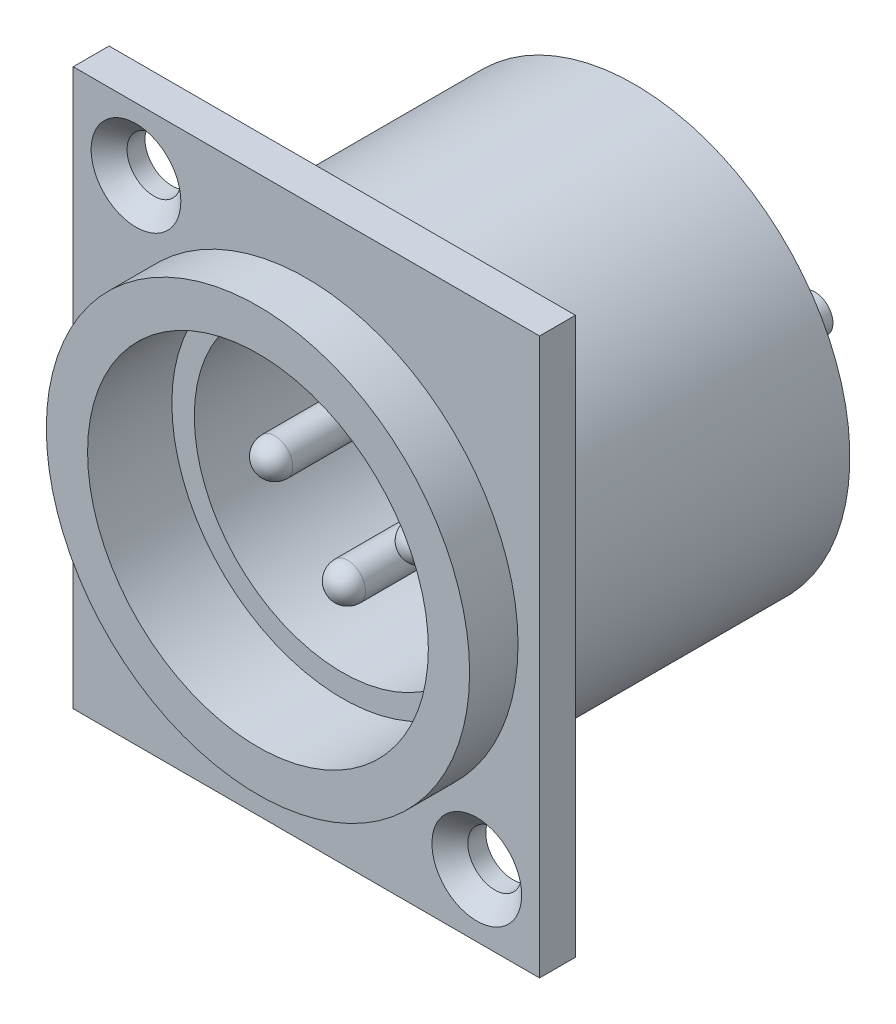
ISO-10303-21;
HEADER;
FILE_DESCRIPTION(('STEP AP214'),'2;1');
FILE_NAME('part.step','',(''),(''),'','','');
FILE_SCHEMA(('AUTOMOTIVE_DESIGN { 1 0 10303 214 1 1 1 1 }'));
ENDSEC;
DATA;
#1=APPLICATION_CONTEXT('core data for automotive mechanical design processes');
#2=APPLICATION_PROTOCOL_DEFINITION('international standard','automotive_design',2000,#1);
#3=PRODUCT_CONTEXT('',#1,'mechanical');
#4=PRODUCT('Part','Part','',(#3));
#5=PRODUCT_RELATED_PRODUCT_CATEGORY('part','',(#4));
#6=PRODUCT_DEFINITION_FORMATION('','',#4);
#7=PRODUCT_DEFINITION_CONTEXT('part definition',#1,'design');
#8=PRODUCT_DEFINITION('design','',#6,#7);
#9=PRODUCT_DEFINITION_SHAPE('','',#8);
#10=(LENGTH_UNIT() NAMED_UNIT(*) SI_UNIT(.MILLI.,.METRE.));
#11=(NAMED_UNIT(*) PLANE_ANGLE_UNIT() SI_UNIT($,.RADIAN.));
#12=(NAMED_UNIT(*) SI_UNIT($,.STERADIAN.) SOLID_ANGLE_UNIT());
#13=UNCERTAINTY_MEASURE_WITH_UNIT(LENGTH_MEASURE(1.E-05),#10,'distance_accuracy_value','');
#14=(GEOMETRIC_REPRESENTATION_CONTEXT(3) GLOBAL_UNCERTAINTY_ASSIGNED_CONTEXT((#13)) GLOBAL_UNIT_ASSIGNED_CONTEXT((#10,
#11,#12)) REPRESENTATION_CONTEXT('',''));
#15=CARTESIAN_POINT('',(0.,0.,0.));
#16=DIRECTION('',(0.,0.,1.));
#17=DIRECTION('',(1.,0.,0.));
#18=AXIS2_PLACEMENT_3D('',#15,#16,#17);
#19=CARTESIAN_POINT('',(0.,0.,2.));
#20=DIRECTION('',(0.,0.,1.));
#21=DIRECTION('',(1.,0.,0.));
#22=AXIS2_PLACEMENT_3D('',#19,#20,#21);
#23=PLANE('',#22);
#24=CARTESIAN_POINT('',(12.6835154826958,-19.6666666666667,2.));
#25=DIRECTION('',(0.,0.,1.));
#26=DIRECTION('',(1.,0.,0.));
#27=AXIS2_PLACEMENT_3D('',#24,#25,#26);
#28=CIRCLE('',#27,2.50000000000001);
#29=CARTESIAN_POINT('',(15.1835154826958,-19.6666666666667,2.));
#30=VERTEX_POINT('',#29);
#31=EDGE_CURVE('E123',#30,#30,#28,.F.);
#32=ORIENTED_EDGE('',*,*,#31,.T.);
#33=EDGE_LOOP('',(#32));
#34=FACE_BOUND('',#33,.T.);
#35=CARTESIAN_POINT('',(-6.31648451730421,4.33333333333335,2.));
#36=DIRECTION('',(0.,0.,1.));
#37=DIRECTION('',(1.,0.,0.));
#38=AXIS2_PLACEMENT_3D('',#35,#36,#37);
#39=CIRCLE('',#38,2.5);
#40=CARTESIAN_POINT('',(-3.81648451730422,4.33333333333335,2.));
#41=VERTEX_POINT('',#40);
#42=EDGE_CURVE('E120',#41,#41,#39,.F.);
#43=ORIENTED_EDGE('',*,*,#42,.T.);
#44=EDGE_LOOP('',(#43));
#45=FACE_BOUND('',#44,.T.);
#46=DIRECTION('',(0.,-1.,0.));
#47=VECTOR('',#46,1.);
#48=CARTESIAN_POINT('',(-9.81648451730421,7.83333333333335,2.));
#49=LINE('',#48,#47);
#50=CARTESIAN_POINT('',(-9.81648451730421,7.83333333333335,2.));
#51=VERTEX_POINT('',#50);
#52=CARTESIAN_POINT('',(-9.81648451730421,-23.1666666666667,2.));
#53=VERTEX_POINT('',#52);
#54=EDGE_CURVE('E92',#51,#53,#49,.T.);
#55=ORIENTED_EDGE('',*,*,#54,.T.);
#56=DIRECTION('',(1.,0.,0.));
#57=VECTOR('',#56,1.);
#58=CARTESIAN_POINT('',(-9.81648451730421,-23.1666666666667,2.));
#59=LINE('',#58,#57);
#60=CARTESIAN_POINT('',(16.1835154826958,-23.1666666666667,2.));
#61=VERTEX_POINT('',#60);
#62=EDGE_CURVE('E87',#53,#61,#59,.T.);
#63=ORIENTED_EDGE('',*,*,#62,.T.);
#64=DIRECTION('',(0.,1.,0.));
#65=VECTOR('',#64,1.);
#66=CARTESIAN_POINT('',(16.1835154826958,7.83333333333335,2.));
#67=LINE('',#66,#65);
#68=CARTESIAN_POINT('',(16.1835154826958,7.83333333333335,2.));
#69=VERTEX_POINT('',#68);
#70=EDGE_CURVE('E90',#61,#69,#67,.T.);
#71=ORIENTED_EDGE('',*,*,#70,.T.);
#72=DIRECTION('',(-1.,0.,0.));
#73=VECTOR('',#72,1.);
#74=CARTESIAN_POINT('',(-9.81648451730421,7.83333333333335,2.));
#75=LINE('',#74,#73);
#76=EDGE_CURVE('E56',#69,#51,#75,.T.);
#77=ORIENTED_EDGE('',*,*,#76,.T.);
#78=EDGE_LOOP('',(#55,#63,#71,#77));
#79=FACE_BOUND('',#78,.T.);
#80=CARTESIAN_POINT('',(3.18351548269579,-7.66666666666665,2.));
#81=DIRECTION('',(0.,0.,1.));
#82=DIRECTION('',(1.,0.,0.));
#83=AXIS2_PLACEMENT_3D('',#80,#81,#82);
#84=CIRCLE('',#83,11.8);
#85=CARTESIAN_POINT('',(14.9835154826958,-7.66666666666665,2.));
#86=VERTEX_POINT('',#85);
#87=EDGE_CURVE('E218',#86,#86,#84,.T.);
#88=ORIENTED_EDGE('',*,*,#87,.F.);
#89=EDGE_LOOP('',(#88));
#90=FACE_BOUND('',#89,.T.);
#91=ADVANCED_FACE('F39',(#34,#45,#79,#90),#23,.T.);
#92=CARTESIAN_POINT('',(0.,0.,0.));
#93=DIRECTION('',(0.,0.,1.));
#94=DIRECTION('',(1.,0.,0.));
#95=AXIS2_PLACEMENT_3D('',#92,#93,#94);
#96=PLANE('',#95);
#97=CARTESIAN_POINT('',(3.18351548269579,-7.66666666666665,0.));
#98=DIRECTION('',(0.,0.,-1.));
#99=DIRECTION('',(-1.,0.,0.));
#100=AXIS2_PLACEMENT_3D('',#97,#98,#99);
#101=CIRCLE('',#100,12.);
#102=CARTESIAN_POINT('',(-8.81648451730421,-7.66666666666665,0.));
#103=VERTEX_POINT('',#102);
#104=EDGE_CURVE('E129',#103,#103,#101,.T.);
#105=ORIENTED_EDGE('',*,*,#104,.F.);
#106=EDGE_LOOP('',(#105));
#107=FACE_BOUND('',#106,.T.);
#108=DIRECTION('',(0.,-1.,0.));
#109=VECTOR('',#108,1.);
#110=CARTESIAN_POINT('',(-9.81648451730421,7.83333333333335,0.));
#111=LINE('',#110,#109);
#112=CARTESIAN_POINT('',(-9.81648451730421,7.83333333333335,0.));
#113=VERTEX_POINT('',#112);
#114=CARTESIAN_POINT('',(-9.81648451730421,-23.1666666666667,0.));
#115=VERTEX_POINT('',#114);
#116=EDGE_CURVE('E107',#113,#115,#111,.T.);
#117=ORIENTED_EDGE('',*,*,#116,.F.);
#118=DIRECTION('',(-1.,0.,0.));
#119=VECTOR('',#118,1.);
#120=CARTESIAN_POINT('',(-9.81648451730421,7.83333333333335,0.));
#121=LINE('',#120,#119);
#122=CARTESIAN_POINT('',(16.1835154826958,7.83333333333335,0.));
#123=VERTEX_POINT('',#122);
#124=EDGE_CURVE('E79',#123,#113,#121,.T.);
#125=ORIENTED_EDGE('',*,*,#124,.F.);
#126=DIRECTION('',(0.,1.,0.));
#127=VECTOR('',#126,1.);
#128=CARTESIAN_POINT('',(16.1835154826958,7.83333333333335,0.));
#129=LINE('',#128,#127);
#130=CARTESIAN_POINT('',(16.1835154826958,-23.1666666666667,0.));
#131=VERTEX_POINT('',#130);
#132=EDGE_CURVE('E73',#131,#123,#129,.T.);
#133=ORIENTED_EDGE('',*,*,#132,.F.);
#134=DIRECTION('',(1.,0.,0.));
#135=VECTOR('',#134,1.);
#136=CARTESIAN_POINT('',(-9.81648451730421,-23.1666666666667,0.));
#137=LINE('',#136,#135);
#138=EDGE_CURVE('E97',#115,#131,#137,.T.);
#139=ORIENTED_EDGE('',*,*,#138,.F.);
#140=EDGE_LOOP('',(#117,#125,#133,#139));
#141=FACE_BOUND('',#140,.T.);
#142=CARTESIAN_POINT('',(-6.31648451730421,4.33333333333335,0.));
#143=DIRECTION('',(0.,0.,1.));
#144=DIRECTION('',(1.,0.,0.));
#145=AXIS2_PLACEMENT_3D('',#142,#143,#144);
#146=CIRCLE('',#145,1.5);
#147=CARTESIAN_POINT('',(-4.81648451730421,4.33333333333335,0.));
#148=VERTEX_POINT('',#147);
#149=EDGE_CURVE('E208',#148,#148,#146,.T.);
#150=ORIENTED_EDGE('',*,*,#149,.T.);
#151=EDGE_LOOP('',(#150));
#152=FACE_BOUND('',#151,.T.);
#153=CARTESIAN_POINT('',(12.6835154826958,-19.6666666666667,0.));
#154=DIRECTION('',(0.,0.,1.));
#155=DIRECTION('',(1.,0.,0.));
#156=AXIS2_PLACEMENT_3D('',#153,#154,#155);
#157=CIRCLE('',#156,1.5);
#158=CARTESIAN_POINT('',(14.1835154826958,-19.6666666666667,0.));
#159=VERTEX_POINT('',#158);
#160=EDGE_CURVE('E210',#159,#159,#157,.T.);
#161=ORIENTED_EDGE('',*,*,#160,.T.);
#162=EDGE_LOOP('',(#161));
#163=FACE_BOUND('',#162,.T.);
#164=ADVANCED_FACE('F159',(#107,#141,#152,#163),#96,.F.);
#165=CARTESIAN_POINT('',(-9.81648451730421,7.83333333333335,2.));
#166=DIRECTION('',(1.,0.,0.));
#167=DIRECTION('',(0.,1.,0.));
#168=AXIS2_PLACEMENT_3D('',#165,#166,#167);
#169=PLANE('',#168);
#170=ORIENTED_EDGE('',*,*,#116,.T.);
#171=DIRECTION('',(0.,0.,-1.));
#172=VECTOR('',#171,1.);
#173=CARTESIAN_POINT('',(-9.81648451730421,-23.1666666666667,2.));
#174=LINE('',#173,#172);
#175=EDGE_CURVE('E98',#53,#115,#174,.T.);
#176=ORIENTED_EDGE('',*,*,#175,.F.);
#177=ORIENTED_EDGE('',*,*,#54,.F.);
#178=DIRECTION('',(0.,0.,-1.));
#179=VECTOR('',#178,1.);
#180=CARTESIAN_POINT('',(-9.81648451730421,7.83333333333335,2.));
#181=LINE('',#180,#179);
#182=EDGE_CURVE('E103',#51,#113,#181,.T.);
#183=ORIENTED_EDGE('',*,*,#182,.T.);
#184=EDGE_LOOP('',(#170,#176,#177,#183));
#185=FACE_BOUND('',#184,.T.);
#186=ADVANCED_FACE('F165',(#185),#169,.F.);
#187=CARTESIAN_POINT('',(-9.81648451730421,-23.1666666666667,2.));
#188=DIRECTION('',(0.,1.,0.));
#189=DIRECTION('',(0.,0.,1.));
#190=AXIS2_PLACEMENT_3D('',#187,#188,#189);
#191=PLANE('',#190);
#192=ORIENTED_EDGE('',*,*,#138,.T.);
#193=DIRECTION('',(0.,0.,-1.));
#194=VECTOR('',#193,1.);
#195=CARTESIAN_POINT('',(16.1835154826958,-23.1666666666667,2.));
#196=LINE('',#195,#194);
#197=EDGE_CURVE('E95',#61,#131,#196,.T.);
#198=ORIENTED_EDGE('',*,*,#197,.F.);
#199=ORIENTED_EDGE('',*,*,#62,.F.);
#200=ORIENTED_EDGE('',*,*,#175,.T.);
#201=EDGE_LOOP('',(#192,#198,#199,#200));
#202=FACE_BOUND('',#201,.T.);
#203=ADVANCED_FACE('F96',(#202),#191,.F.);
#204=CARTESIAN_POINT('',(16.1835154826958,7.83333333333335,2.));
#205=DIRECTION('',(-1.,0.,0.));
#206=DIRECTION('',(0.,0.,1.));
#207=AXIS2_PLACEMENT_3D('',#204,#205,#206);
#208=PLANE('',#207);
#209=ORIENTED_EDGE('',*,*,#132,.T.);
#210=DIRECTION('',(0.,0.,-1.));
#211=VECTOR('',#210,1.);
#212=CARTESIAN_POINT('',(16.1835154826958,7.83333333333335,2.));
#213=LINE('',#212,#211);
#214=EDGE_CURVE('E99',#69,#123,#213,.T.);
#215=ORIENTED_EDGE('',*,*,#214,.F.);
#216=ORIENTED_EDGE('',*,*,#70,.F.);
#217=ORIENTED_EDGE('',*,*,#197,.T.);
#218=EDGE_LOOP('',(#209,#215,#216,#217));
#219=FACE_BOUND('',#218,.T.);
#220=ADVANCED_FACE('F101',(#219),#208,.F.);
#221=CARTESIAN_POINT('',(-9.81648451730421,7.83333333333335,2.));
#222=DIRECTION('',(0.,-1.,0.));
#223=DIRECTION('',(0.,0.,-1.));
#224=AXIS2_PLACEMENT_3D('',#221,#222,#223);
#225=PLANE('',#224);
#226=ORIENTED_EDGE('',*,*,#124,.T.);
#227=ORIENTED_EDGE('',*,*,#182,.F.);
#228=ORIENTED_EDGE('',*,*,#76,.F.);
#229=ORIENTED_EDGE('',*,*,#214,.T.);
#230=EDGE_LOOP('',(#226,#227,#228,#229));
#231=FACE_BOUND('',#230,.T.);
#232=ADVANCED_FACE('F173',(#231),#225,.F.);
#233=CARTESIAN_POINT('',(3.18351548269579,-7.66666666666665,2.));
#234=DIRECTION('',(0.,0.,-1.));
#235=DIRECTION('',(-1.,0.,0.));
#236=AXIS2_PLACEMENT_3D('',#233,#234,#235);
#237=CYLINDRICAL_SURFACE('',#236,9.5);
#238=CARTESIAN_POINT('',(3.18351548269579,-7.66666666666665,0.));
#239=DIRECTION('',(0.,0.,1.));
#240=DIRECTION('',(1.,0.,0.));
#241=AXIS2_PLACEMENT_3D('',#238,#239,#240);
#242=CIRCLE('',#241,9.5);
#243=CARTESIAN_POINT('',(12.6835154826958,-7.66666666666665,0.));
#244=VERTEX_POINT('',#243);
#245=EDGE_CURVE('E110',#244,#244,#242,.T.);
#246=ORIENTED_EDGE('',*,*,#245,.F.);
#247=EDGE_LOOP('',(#246));
#248=FACE_BOUND('',#247,.T.);
#249=CARTESIAN_POINT('',(3.18351548269579,-7.66666666666665,4.7));
#250=DIRECTION('',(0.,0.,1.));
#251=DIRECTION('',(1.,0.,0.));
#252=AXIS2_PLACEMENT_3D('',#249,#250,#251);
#253=CIRCLE('',#252,9.5);
#254=CARTESIAN_POINT('',(12.6835154826958,-7.66666666666665,4.7));
#255=VERTEX_POINT('',#254);
#256=EDGE_CURVE('E221',#255,#255,#253,.T.);
#257=ORIENTED_EDGE('',*,*,#256,.T.);
#258=EDGE_LOOP('',(#257));
#259=FACE_BOUND('',#258,.T.);
#260=ADVANCED_FACE('F170',(#248,#259),#237,.F.);
#261=CARTESIAN_POINT('',(-6.31648451730421,4.33333333333335,2.));
#262=DIRECTION('',(0.,0.,-1.));
#263=DIRECTION('',(-1.,0.,0.));
#264=AXIS2_PLACEMENT_3D('',#261,#262,#263);
#265=CYLINDRICAL_SURFACE('',#264,1.5);
#266=CARTESIAN_POINT('',(-6.31648451730421,4.33333333333335,0.999999999999999));
#267=DIRECTION('',(0.,0.,1.));
#268=DIRECTION('',(1.,0.,0.));
#269=AXIS2_PLACEMENT_3D('',#266,#267,#268);
#270=CIRCLE('',#269,1.5);
#271=CARTESIAN_POINT('',(-4.81648451730421,4.33333333333335,0.999999999999999));
#272=VERTEX_POINT('',#271);
#273=EDGE_CURVE('E126',#272,#272,#270,.T.);
#274=ORIENTED_EDGE('',*,*,#273,.T.);
#275=EDGE_LOOP('',(#274));
#276=FACE_BOUND('',#275,.T.);
#277=ORIENTED_EDGE('',*,*,#149,.F.);
#278=EDGE_LOOP('',(#277));
#279=FACE_BOUND('',#278,.T.);
#280=ADVANCED_FACE('F202',(#276,#279),#265,.F.);
#281=CARTESIAN_POINT('',(12.6835154826958,-19.6666666666667,2.));
#282=DIRECTION('',(0.,0.,-1.));
#283=DIRECTION('',(-1.,0.,0.));
#284=AXIS2_PLACEMENT_3D('',#281,#282,#283);
#285=CYLINDRICAL_SURFACE('',#284,1.5);
#286=CARTESIAN_POINT('',(12.6835154826958,-19.6666666666667,0.99999999999999));
#287=DIRECTION('',(0.,0.,1.));
#288=DIRECTION('',(1.,0.,0.));
#289=AXIS2_PLACEMENT_3D('',#286,#287,#288);
#290=CIRCLE('',#289,1.5);
#291=CARTESIAN_POINT('',(14.1835154826958,-19.6666666666667,0.99999999999999));
#292=VERTEX_POINT('',#291);
#293=EDGE_CURVE('E117',#292,#292,#290,.T.);
#294=ORIENTED_EDGE('',*,*,#293,.T.);
#295=EDGE_LOOP('',(#294));
#296=FACE_BOUND('',#295,.T.);
#297=ORIENTED_EDGE('',*,*,#160,.F.);
#298=EDGE_LOOP('',(#297));
#299=FACE_BOUND('',#298,.T.);
#300=ADVANCED_FACE('F205',(#296,#299),#285,.F.);
#301=CARTESIAN_POINT('',(3.18351548269579,-7.66666666666665,4.7));
#302=DIRECTION('',(0.,0.,1.));
#303=DIRECTION('',(1.,0.,0.));
#304=AXIS2_PLACEMENT_3D('',#301,#302,#303);
#305=PLANE('',#304);
#306=CARTESIAN_POINT('',(3.18351548269579,-7.66666666666665,4.7));
#307=DIRECTION('',(0.,0.,1.));
#308=DIRECTION('',(1.,0.,0.));
#309=AXIS2_PLACEMENT_3D('',#306,#307,#308);
#310=CIRCLE('',#309,11.8);
#311=CARTESIAN_POINT('',(14.9835154826958,-7.66666666666665,4.7));
#312=VERTEX_POINT('',#311);
#313=EDGE_CURVE('E215',#312,#312,#310,.T.);
#314=ORIENTED_EDGE('',*,*,#313,.T.);
#315=EDGE_LOOP('',(#314));
#316=FACE_BOUND('',#315,.T.);
#317=ORIENTED_EDGE('',*,*,#256,.F.);
#318=EDGE_LOOP('',(#317));
#319=FACE_BOUND('',#318,.T.);
#320=ADVANCED_FACE('F301',(#316,#319),#305,.T.);
#321=CARTESIAN_POINT('',(3.18351548269579,-7.66666666666665,4.7));
#322=DIRECTION('',(0.,0.,-1.));
#323=DIRECTION('',(-1.,0.,0.));
#324=AXIS2_PLACEMENT_3D('',#321,#322,#323);
#325=CYLINDRICAL_SURFACE('',#324,11.8);
#326=ORIENTED_EDGE('',*,*,#313,.F.);
#327=EDGE_LOOP('',(#326));
#328=FACE_BOUND('',#327,.T.);
#329=ORIENTED_EDGE('',*,*,#87,.T.);
#330=EDGE_LOOP('',(#329));
#331=FACE_BOUND('',#330,.T.);
#332=ADVANCED_FACE('F187',(#328,#331),#325,.T.);
#333=CARTESIAN_POINT('',(12.6835154826958,-19.6666666666667,0.99999999999999));
#334=DIRECTION('',(0.,0.,1.));
#335=DIRECTION('',(1.,0.,0.));
#336=AXIS2_PLACEMENT_3D('',#333,#334,#335);
#337=CONICAL_SURFACE('',#336,1.5,0.785398163397446);
#338=ORIENTED_EDGE('',*,*,#31,.F.);
#339=EDGE_LOOP('',(#338));
#340=FACE_BOUND('',#339,.T.);
#341=ORIENTED_EDGE('',*,*,#293,.F.);
#342=EDGE_LOOP('',(#341));
#343=FACE_BOUND('',#342,.T.);
#344=ADVANCED_FACE('F183',(#340,#343),#337,.F.);
#345=CARTESIAN_POINT('',(-6.31648451730421,4.33333333333335,0.999999999999999));
#346=DIRECTION('',(0.,0.,1.));
#347=DIRECTION('',(1.,0.,0.));
#348=AXIS2_PLACEMENT_3D('',#345,#346,#347);
#349=CONICAL_SURFACE('',#348,1.5,0.785398163397447);
#350=ORIENTED_EDGE('',*,*,#42,.F.);
#351=EDGE_LOOP('',(#350));
#352=FACE_BOUND('',#351,.T.);
#353=ORIENTED_EDGE('',*,*,#273,.F.);
#354=EDGE_LOOP('',(#353));
#355=FACE_BOUND('',#354,.T.);
#356=ADVANCED_FACE('F186',(#352,#355),#349,.F.);
#357=CARTESIAN_POINT('',(3.18351548269579,-7.66666666666665,0.));
#358=DIRECTION('',(0.,0.,-1.));
#359=DIRECTION('',(-1.,0.,0.));
#360=AXIS2_PLACEMENT_3D('',#357,#358,#359);
#361=PLANE('',#360);
#362=CARTESIAN_POINT('',(3.18351548269579,-7.66666666666665,0.));
#363=DIRECTION('',(0.,0.,-1.));
#364=DIRECTION('',(-1.,0.,0.));
#365=AXIS2_PLACEMENT_3D('',#362,#363,#364);
#366=CIRCLE('',#365,8.25);
#367=CARTESIAN_POINT('',(-5.06648451730421,-7.66666666666665,0.));
#368=VERTEX_POINT('',#367);
#369=EDGE_CURVE('E226',#368,#368,#366,.T.);
#370=ORIENTED_EDGE('',*,*,#369,.T.);
#371=EDGE_LOOP('',(#370));
#372=FACE_BOUND('',#371,.T.);
#373=ORIENTED_EDGE('',*,*,#245,.T.);
#374=EDGE_LOOP('',(#373));
#375=FACE_BOUND('',#374,.T.);
#376=ADVANCED_FACE('F190',(#372,#375),#361,.F.);
#377=CARTESIAN_POINT('',(3.18351548269579,-7.66666666666665,-14.3));
#378=DIRECTION('',(0.,0.,1.));
#379=DIRECTION('',(1.,0.,0.));
#380=AXIS2_PLACEMENT_3D('',#377,#378,#379);
#381=CYLINDRICAL_SURFACE('',#380,12.);
#382=ORIENTED_EDGE('',*,*,#104,.T.);
#383=EDGE_LOOP('',(#382));
#384=FACE_BOUND('',#383,.T.);
#385=CARTESIAN_POINT('',(3.18351548269579,-7.66666666666665,-16.3));
#386=DIRECTION('',(0.,0.,-1.));
#387=DIRECTION('',(-1.,0.,0.));
#388=AXIS2_PLACEMENT_3D('',#385,#386,#387);
#389=CIRCLE('',#388,12.);
#390=CARTESIAN_POINT('',(-8.81648451730421,-7.66666666666665,-16.3));
#391=VERTEX_POINT('',#390);
#392=EDGE_CURVE('E234',#391,#391,#389,.T.);
#393=ORIENTED_EDGE('',*,*,#392,.F.);
#394=EDGE_LOOP('',(#393));
#395=FACE_BOUND('',#394,.T.);
#396=ADVANCED_FACE('F195',(#384,#395),#381,.T.);
#397=CARTESIAN_POINT('',(3.18351548269579,-7.66666666666665,-14.3));
#398=DIRECTION('',(0.,0.,1.));
#399=DIRECTION('',(1.,0.,0.));
#400=AXIS2_PLACEMENT_3D('',#397,#398,#399);
#401=CYLINDRICAL_SURFACE('',#400,8.25);
#402=CARTESIAN_POINT('',(3.18351548269579,-7.66666666666665,-14.3));
#403=DIRECTION('',(0.,0.,-1.));
#404=DIRECTION('',(-1.,0.,0.));
#405=AXIS2_PLACEMENT_3D('',#402,#403,#404);
#406=CIRCLE('',#405,8.25);
#407=CARTESIAN_POINT('',(-5.06648451730421,-7.66666666666665,-14.3));
#408=VERTEX_POINT('',#407);
#409=EDGE_CURVE('E231',#408,#408,#406,.T.);
#410=ORIENTED_EDGE('',*,*,#409,.T.);
#411=EDGE_LOOP('',(#410));
#412=FACE_BOUND('',#411,.T.);
#413=ORIENTED_EDGE('',*,*,#369,.F.);
#414=EDGE_LOOP('',(#413));
#415=FACE_BOUND('',#414,.T.);
#416=ADVANCED_FACE('F293',(#412,#415),#401,.F.);
#417=CARTESIAN_POINT('',(3.18351548269579,-7.66666666666665,-14.3));
#418=DIRECTION('',(0.,0.,-1.));
#419=DIRECTION('',(-1.,0.,0.));
#420=AXIS2_PLACEMENT_3D('',#417,#418,#419);
#421=PLANE('',#420);
#422=CARTESIAN_POINT('',(3.18351548269578,-11.6466666666667,-14.3));
#423=DIRECTION('',(0.,0.,-1.));
#424=DIRECTION('',(-1.,0.,0.));
#425=AXIS2_PLACEMENT_3D('',#422,#423,#424);
#426=CIRCLE('',#425,1.);
#427=CARTESIAN_POINT('',(2.18351548269578,-11.6466666666667,-14.3));
#428=VERTEX_POINT('',#427);
#429=EDGE_CURVE('E249',#428,#428,#426,.T.);
#430=ORIENTED_EDGE('',*,*,#429,.T.);
#431=EDGE_LOOP('',(#430));
#432=FACE_BOUND('',#431,.T.);
#433=CARTESIAN_POINT('',(-0.876484517304215,-7.66666666666665,-14.3));
#434=DIRECTION('',(0.,0.,-1.));
#435=DIRECTION('',(-1.,0.,0.));
#436=AXIS2_PLACEMENT_3D('',#433,#434,#435);
#437=CIRCLE('',#436,1.);
#438=CARTESIAN_POINT('',(-1.87648451730422,-7.66666666666665,-14.3));
#439=VERTEX_POINT('',#438);
#440=EDGE_CURVE('E243',#439,#439,#437,.T.);
#441=ORIENTED_EDGE('',*,*,#440,.T.);
#442=EDGE_LOOP('',(#441));
#443=FACE_BOUND('',#442,.T.);
#444=CARTESIAN_POINT('',(7.24351548269578,-7.66666666666665,-14.3));
#445=DIRECTION('',(0.,0.,-1.));
#446=DIRECTION('',(-1.,0.,0.));
#447=AXIS2_PLACEMENT_3D('',#444,#445,#446);
#448=CIRCLE('',#447,1.);
#449=CARTESIAN_POINT('',(6.24351548269578,-7.66666666666665,-14.3));
#450=VERTEX_POINT('',#449);
#451=EDGE_CURVE('E237',#450,#450,#448,.T.);
#452=ORIENTED_EDGE('',*,*,#451,.T.);
#453=EDGE_LOOP('',(#452));
#454=FACE_BOUND('',#453,.T.);
#455=ORIENTED_EDGE('',*,*,#409,.F.);
#456=EDGE_LOOP('',(#455));
#457=FACE_BOUND('',#456,.T.);
#458=ADVANCED_FACE('F289',(#432,#443,#454,#457),#421,.F.);
#459=CARTESIAN_POINT('',(3.18351548269579,-7.66666666666665,-16.3));
#460=DIRECTION('',(0.,0.,-1.));
#461=DIRECTION('',(-1.,0.,0.));
#462=AXIS2_PLACEMENT_3D('',#459,#460,#461);
#463=PLANE('',#462);
#464=CARTESIAN_POINT('',(3.18351548269578,-11.6466666666667,-16.3));
#465=DIRECTION('',(0.,0.,-1.));
#466=DIRECTION('',(-1.,0.,0.));
#467=AXIS2_PLACEMENT_3D('',#464,#465,#466);
#468=CIRCLE('',#467,1.);
#469=CARTESIAN_POINT('',(2.18351548269578,-11.6466666666667,-16.3));
#470=VERTEX_POINT('',#469);
#471=EDGE_CURVE('E136',#470,#470,#468,.T.);
#472=ORIENTED_EDGE('',*,*,#471,.F.);
#473=EDGE_LOOP('',(#472));
#474=FACE_BOUND('',#473,.T.);
#475=CARTESIAN_POINT('',(-0.876484517304215,-7.66666666666665,-16.3));
#476=DIRECTION('',(0.,0.,-1.));
#477=DIRECTION('',(-1.,0.,0.));
#478=AXIS2_PLACEMENT_3D('',#475,#476,#477);
#479=CIRCLE('',#478,1.);
#480=CARTESIAN_POINT('',(-1.87648451730422,-7.66666666666665,-16.3));
#481=VERTEX_POINT('',#480);
#482=EDGE_CURVE('E133',#481,#481,#479,.T.);
#483=ORIENTED_EDGE('',*,*,#482,.F.);
#484=EDGE_LOOP('',(#483));
#485=FACE_BOUND('',#484,.T.);
#486=CARTESIAN_POINT('',(7.24351548269578,-7.66666666666665,-16.3));
#487=DIRECTION('',(0.,0.,-1.));
#488=DIRECTION('',(-1.,0.,0.));
#489=AXIS2_PLACEMENT_3D('',#486,#487,#488);
#490=CIRCLE('',#489,1.);
#491=CARTESIAN_POINT('',(6.24351548269578,-7.66666666666665,-16.3));
#492=VERTEX_POINT('',#491);
#493=EDGE_CURVE('E130',#492,#492,#490,.T.);
#494=ORIENTED_EDGE('',*,*,#493,.F.);
#495=EDGE_LOOP('',(#494));
#496=FACE_BOUND('',#495,.T.);
#497=ORIENTED_EDGE('',*,*,#392,.T.);
#498=EDGE_LOOP('',(#497));
#499=FACE_BOUND('',#498,.T.);
#500=ADVANCED_FACE('F282',(#474,#485,#496,#499),#463,.T.);
#501=CARTESIAN_POINT('',(7.24351548269578,-7.66666666666665,-22.3));
#502=DIRECTION('',(0.,0.,1.));
#503=DIRECTION('',(1.,0.,0.));
#504=AXIS2_PLACEMENT_3D('',#501,#502,#503);
#505=PLANE('',#504);
#506=CARTESIAN_POINT('',(7.24351548269578,-7.66666666666665,-22.3));
#507=DIRECTION('',(0.,0.,1.));
#508=DIRECTION('',(1.,0.,0.));
#509=AXIS2_PLACEMENT_3D('',#506,#507,#508);
#510=CIRCLE('',#509,1.);
#511=CARTESIAN_POINT('',(8.24351548269578,-7.66666666666665,-22.3));
#512=VERTEX_POINT('',#511);
#513=EDGE_CURVE('E240',#512,#512,#510,.T.);
#514=ORIENTED_EDGE('',*,*,#513,.F.);
#515=EDGE_LOOP('',(#514));
#516=FACE_BOUND('',#515,.T.);
#517=ADVANCED_FACE('F278',(#516),#505,.F.);
#518=CARTESIAN_POINT('',(7.24351548269578,-7.66666666666665,-22.3));
#519=DIRECTION('',(0.,0.,1.));
#520=DIRECTION('',(1.,0.,0.));
#521=AXIS2_PLACEMENT_3D('',#518,#519,#520);
#522=CYLINDRICAL_SURFACE('',#521,1.);
#523=ORIENTED_EDGE('',*,*,#493,.T.);
#524=EDGE_LOOP('',(#523));
#525=FACE_BOUND('',#524,.T.);
#526=ORIENTED_EDGE('',*,*,#513,.T.);
#527=EDGE_LOOP('',(#526));
#528=FACE_BOUND('',#527,.T.);
#529=ADVANCED_FACE('F281',(#525,#528),#522,.T.);
#530=CARTESIAN_POINT('',(7.24351548269578,-7.66666666666665,-0.300000000000002));
#531=DIRECTION('',(0.,0.,1.));
#532=DIRECTION('',(1.,0.,0.));
#533=AXIS2_PLACEMENT_3D('',#530,#531,#532);
#534=CIRCLE('',#533,1.);
#535=CARTESIAN_POINT('',(8.24351548269578,-7.66666666666665,-0.300000000000002));
#536=VERTEX_POINT('',#535);
#537=EDGE_CURVE('E48',#536,#536,#534,.F.);
#538=ORIENTED_EDGE('',*,*,#537,.T.);
#539=EDGE_LOOP('',(#538));
#540=FACE_BOUND('',#539,.T.);
#541=ORIENTED_EDGE('',*,*,#451,.F.);
#542=EDGE_LOOP('',(#541));
#543=FACE_BOUND('',#542,.T.);
#544=ADVANCED_FACE('F144',(#540,#543),#522,.T.);
#545=CARTESIAN_POINT('',(-0.876484517304215,-7.66666666666665,-22.3));
#546=DIRECTION('',(0.,0.,1.));
#547=DIRECTION('',(1.,0.,0.));
#548=AXIS2_PLACEMENT_3D('',#545,#546,#547);
#549=PLANE('',#548);
#550=CARTESIAN_POINT('',(-0.876484517304215,-7.66666666666665,-22.3));
#551=DIRECTION('',(0.,0.,1.));
#552=DIRECTION('',(1.,0.,0.));
#553=AXIS2_PLACEMENT_3D('',#550,#551,#552);
#554=CIRCLE('',#553,1.);
#555=CARTESIAN_POINT('',(0.123515482695785,-7.66666666666665,-22.3));
#556=VERTEX_POINT('',#555);
#557=EDGE_CURVE('E246',#556,#556,#554,.T.);
#558=ORIENTED_EDGE('',*,*,#557,.F.);
#559=EDGE_LOOP('',(#558));
#560=FACE_BOUND('',#559,.T.);
#561=ADVANCED_FACE('F272',(#560),#549,.F.);
#562=CARTESIAN_POINT('',(-0.876484517304215,-7.66666666666665,-22.3));
#563=DIRECTION('',(0.,0.,1.));
#564=DIRECTION('',(1.,0.,0.));
#565=AXIS2_PLACEMENT_3D('',#562,#563,#564);
#566=CYLINDRICAL_SURFACE('',#565,1.);
#567=ORIENTED_EDGE('',*,*,#482,.T.);
#568=EDGE_LOOP('',(#567));
#569=FACE_BOUND('',#568,.T.);
#570=ORIENTED_EDGE('',*,*,#557,.T.);
#571=EDGE_LOOP('',(#570));
#572=FACE_BOUND('',#571,.T.);
#573=ADVANCED_FACE('F268',(#569,#572),#566,.T.);
#574=CARTESIAN_POINT('',(-0.876484517304215,-7.66666666666665,-0.300000000000002));
#575=DIRECTION('',(0.,0.,1.));
#576=DIRECTION('',(1.,0.,0.));
#577=AXIS2_PLACEMENT_3D('',#574,#575,#576);
#578=CIRCLE('',#577,1.);
#579=CARTESIAN_POINT('',(0.123515482695785,-7.66666666666665,-0.300000000000002));
#580=VERTEX_POINT('',#579);
#581=EDGE_CURVE('E11',#580,#580,#578,.F.);
#582=ORIENTED_EDGE('',*,*,#581,.T.);
#583=EDGE_LOOP('',(#582));
#584=FACE_BOUND('',#583,.T.);
#585=ORIENTED_EDGE('',*,*,#440,.F.);
#586=EDGE_LOOP('',(#585));
#587=FACE_BOUND('',#586,.T.);
#588=ADVANCED_FACE('F260',(#584,#587),#566,.T.);
#589=CARTESIAN_POINT('',(3.18351548269578,-11.6466666666667,-22.3));
#590=DIRECTION('',(0.,0.,1.));
#591=DIRECTION('',(1.,0.,0.));
#592=AXIS2_PLACEMENT_3D('',#589,#590,#591);
#593=PLANE('',#592);
#594=CARTESIAN_POINT('',(3.18351548269578,-11.6466666666667,-22.3));
#595=DIRECTION('',(0.,0.,1.));
#596=DIRECTION('',(1.,0.,0.));
#597=AXIS2_PLACEMENT_3D('',#594,#595,#596);
#598=CIRCLE('',#597,1.);
#599=CARTESIAN_POINT('',(4.18351548269578,-11.6466666666667,-22.3));
#600=VERTEX_POINT('',#599);
#601=EDGE_CURVE('E252',#600,#600,#598,.T.);
#602=ORIENTED_EDGE('',*,*,#601,.F.);
#603=EDGE_LOOP('',(#602));
#604=FACE_BOUND('',#603,.T.);
#605=ADVANCED_FACE('F258',(#604),#593,.F.);
#606=CARTESIAN_POINT('',(3.18351548269578,-11.6466666666667,-22.3));
#607=DIRECTION('',(0.,0.,1.));
#608=DIRECTION('',(1.,0.,0.));
#609=AXIS2_PLACEMENT_3D('',#606,#607,#608);
#610=CYLINDRICAL_SURFACE('',#609,1.);
#611=ORIENTED_EDGE('',*,*,#471,.T.);
#612=EDGE_LOOP('',(#611));
#613=FACE_BOUND('',#612,.T.);
#614=ORIENTED_EDGE('',*,*,#601,.T.);
#615=EDGE_LOOP('',(#614));
#616=FACE_BOUND('',#615,.T.);
#617=ADVANCED_FACE('F256',(#613,#616),#610,.T.);
#618=CARTESIAN_POINT('',(3.18351548269578,-11.6466666666667,-0.300000000000002));
#619=DIRECTION('',(0.,0.,1.));
#620=DIRECTION('',(1.,0.,0.));
#621=AXIS2_PLACEMENT_3D('',#618,#619,#620);
#622=CIRCLE('',#621,1.);
#623=CARTESIAN_POINT('',(4.18351548269578,-11.6466666666667,-0.300000000000002));
#624=VERTEX_POINT('',#623);
#625=EDGE_CURVE('E139',#624,#624,#622,.F.);
#626=ORIENTED_EDGE('',*,*,#625,.T.);
#627=EDGE_LOOP('',(#626));
#628=FACE_BOUND('',#627,.T.);
#629=ORIENTED_EDGE('',*,*,#429,.F.);
#630=EDGE_LOOP('',(#629));
#631=FACE_BOUND('',#630,.T.);
#632=ADVANCED_FACE('F155',(#628,#631),#610,.T.);
#633=CARTESIAN_POINT('',(3.18351548269578,-11.6466666666667,-0.300000000000002));
#634=DIRECTION('',(0.,0.,1.));
#635=DIRECTION('',(1.,0.,0.));
#636=AXIS2_PLACEMENT_3D('',#633,#634,#635);
#637=SPHERICAL_SURFACE('',#636,1.);
#638=ORIENTED_EDGE('',*,*,#625,.F.);
#639=EDGE_LOOP('',(#638));
#640=FACE_BOUND('',#639,.T.);
#641=ADVANCED_FACE('F149',(#640),#637,.T.);
#642=CARTESIAN_POINT('',(7.24351548269578,-7.66666666666665,-0.300000000000002));
#643=DIRECTION('',(0.,0.,1.));
#644=DIRECTION('',(1.,0.,0.));
#645=AXIS2_PLACEMENT_3D('',#642,#643,#644);
#646=SPHERICAL_SURFACE('',#645,1.);
#647=ORIENTED_EDGE('',*,*,#537,.F.);
#648=EDGE_LOOP('',(#647));
#649=FACE_BOUND('',#648,.T.);
#650=ADVANCED_FACE('F147',(#649),#646,.T.);
#651=CARTESIAN_POINT('',(-0.876484517304215,-7.66666666666665,-0.300000000000002));
#652=DIRECTION('',(0.,0.,1.));
#653=DIRECTION('',(1.,0.,0.));
#654=AXIS2_PLACEMENT_3D('',#651,#652,#653);
#655=SPHERICAL_SURFACE('',#654,1.);
#656=ORIENTED_EDGE('',*,*,#581,.F.);
#657=EDGE_LOOP('',(#656));
#658=FACE_BOUND('',#657,.T.);
#659=ADVANCED_FACE('F41',(#658),#655,.T.);
#660=CLOSED_SHELL('',(#91,#164,#186,#203,#220,#232,#260,#280,#300,#320,#332,#344,#356,#376,#396,
#416,#458,#500,#517,#529,#544,#561,#573,#588,#605,#617,#632,#641,#650,#659));
#661=MANIFOLD_SOLID_BREP('B2',#660);
#662=ADVANCED_BREP_SHAPE_REPRESENTATION('',(#18,#661),#14);
#663=SHAPE_DEFINITION_REPRESENTATION(#9,#662);
ENDSEC;
END-ISO-10303-21;
